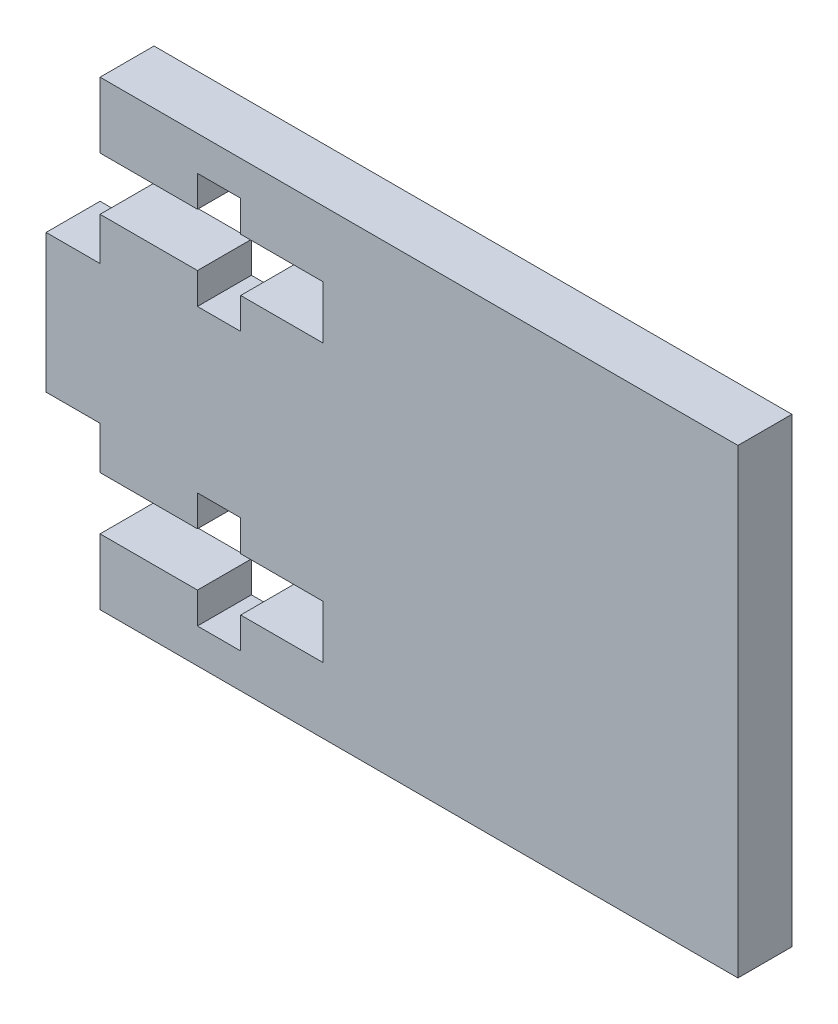
ISO-10303-21;
HEADER;
FILE_DESCRIPTION(('STEP AP214'),'2;1');
FILE_NAME('part.step','',(''),(''),'','','');
FILE_SCHEMA(('AUTOMOTIVE_DESIGN { 1 0 10303 214 1 1 1 1 }'));
ENDSEC;
DATA;
#1=APPLICATION_CONTEXT('core data for automotive mechanical design processes');
#2=APPLICATION_PROTOCOL_DEFINITION('international standard','automotive_design',2000,#1);
#3=PRODUCT_CONTEXT('',#1,'mechanical');
#4=PRODUCT('Part','Part','',(#3));
#5=PRODUCT_RELATED_PRODUCT_CATEGORY('part','',(#4));
#6=PRODUCT_DEFINITION_FORMATION('','',#4);
#7=PRODUCT_DEFINITION_CONTEXT('part definition',#1,'design');
#8=PRODUCT_DEFINITION('design','',#6,#7);
#9=PRODUCT_DEFINITION_SHAPE('','',#8);
#10=(LENGTH_UNIT() NAMED_UNIT(*) SI_UNIT(.MILLI.,.METRE.));
#11=(NAMED_UNIT(*) PLANE_ANGLE_UNIT() SI_UNIT($,.RADIAN.));
#12=(NAMED_UNIT(*) SI_UNIT($,.STERADIAN.) SOLID_ANGLE_UNIT());
#13=UNCERTAINTY_MEASURE_WITH_UNIT(LENGTH_MEASURE(1.E-05),#10,'distance_accuracy_value','');
#14=(GEOMETRIC_REPRESENTATION_CONTEXT(3) GLOBAL_UNCERTAINTY_ASSIGNED_CONTEXT((#13)) GLOBAL_UNIT_ASSIGNED_CONTEXT((#10,
#11,#12)) REPRESENTATION_CONTEXT('',''));
#15=CARTESIAN_POINT('',(0.,0.,0.));
#16=DIRECTION('',(0.,0.,1.));
#17=DIRECTION('',(1.,0.,0.));
#18=AXIS2_PLACEMENT_3D('',#15,#16,#17);
#19=CARTESIAN_POINT('',(-19.05,0.,2.9718));
#20=DIRECTION('',(-1.,0.,0.));
#21=DIRECTION('',(0.,-1.,0.));
#22=AXIS2_PLACEMENT_3D('',#19,#20,#21);
#23=PLANE('',#22);
#24=DIRECTION('',(0.,1.,0.));
#25=VECTOR('',#24,1.);
#26=CARTESIAN_POINT('',(-19.05,0.,2.9718));
#27=LINE('',#26,#25);
#28=CARTESIAN_POINT('',(-19.05,-3.81,2.9718));
#29=VERTEX_POINT('',#28);
#30=CARTESIAN_POINT('',(-19.05,3.81,2.9718));
#31=VERTEX_POINT('',#30);
#32=EDGE_CURVE('E314',#29,#31,#27,.T.);
#33=ORIENTED_EDGE('',*,*,#32,.T.);
#34=DIRECTION('',(0.,0.,-1.));
#35=VECTOR('',#34,1.);
#36=CARTESIAN_POINT('',(-19.05,3.81,2.9718));
#37=LINE('',#36,#35);
#38=CARTESIAN_POINT('',(-19.05,3.81,0.));
#39=VERTEX_POINT('',#38);
#40=EDGE_CURVE('E292',#31,#39,#37,.T.);
#41=ORIENTED_EDGE('',*,*,#40,.T.);
#42=DIRECTION('',(0.,1.,0.));
#43=VECTOR('',#42,1.);
#44=CARTESIAN_POINT('',(-19.05,0.,0.));
#45=LINE('',#44,#43);
#46=CARTESIAN_POINT('',(-19.05,-3.81,0.));
#47=VERTEX_POINT('',#46);
#48=EDGE_CURVE('E346',#47,#39,#45,.T.);
#49=ORIENTED_EDGE('',*,*,#48,.F.);
#50=DIRECTION('',(0.,0.,-1.));
#51=VECTOR('',#50,1.);
#52=CARTESIAN_POINT('',(-19.05,-3.81,2.9718));
#53=LINE('',#52,#51);
#54=EDGE_CURVE('E321',#29,#47,#53,.T.);
#55=ORIENTED_EDGE('',*,*,#54,.F.);
#56=EDGE_LOOP('',(#33,#41,#49,#55));
#57=FACE_BOUND('',#56,.T.);
#58=ADVANCED_FACE('F16',(#57),#23,.T.);
#59=CARTESIAN_POINT('',(0.,0.,0.));
#60=DIRECTION('',(0.,0.,1.));
#61=DIRECTION('',(1.,0.,0.));
#62=AXIS2_PLACEMENT_3D('',#59,#60,#61);
#63=PLANE('',#62);
#64=DIRECTION('',(0.,-1.,0.));
#65=VECTOR('',#64,1.);
#66=CARTESIAN_POINT('',(-16.0782,8.255,0.));
#67=LINE('',#66,#65);
#68=CARTESIAN_POINT('',(-16.0782,12.7,0.));
#69=VERTEX_POINT('',#68);
#70=CARTESIAN_POINT('',(-16.0782,9.0805,0.));
#71=VERTEX_POINT('',#70);
#72=EDGE_CURVE('E318',#69,#71,#67,.T.);
#73=ORIENTED_EDGE('',*,*,#72,.F.);
#74=DIRECTION('',(1.,0.,0.));
#75=VECTOR('',#74,1.);
#76=CARTESIAN_POINT('',(0.,12.7,0.));
#77=LINE('',#76,#75);
#78=CARTESIAN_POINT('',(19.05,12.7,0.));
#79=VERTEX_POINT('',#78);
#80=EDGE_CURVE('E324',#69,#79,#77,.T.);
#81=ORIENTED_EDGE('',*,*,#80,.T.);
#82=DIRECTION('',(0.,1.,0.));
#83=VECTOR('',#82,1.);
#84=CARTESIAN_POINT('',(19.05,0.,0.));
#85=LINE('',#84,#83);
#86=CARTESIAN_POINT('',(19.05,-12.7,0.));
#87=VERTEX_POINT('',#86);
#88=EDGE_CURVE('E333',#87,#79,#85,.T.);
#89=ORIENTED_EDGE('',*,*,#88,.F.);
#90=DIRECTION('',(1.,0.,0.));
#91=VECTOR('',#90,1.);
#92=CARTESIAN_POINT('',(0.,-12.7,0.));
#93=LINE('',#92,#91);
#94=CARTESIAN_POINT('',(-16.0782,-12.7,0.));
#95=VERTEX_POINT('',#94);
#96=EDGE_CURVE('E348',#95,#87,#93,.T.);
#97=ORIENTED_EDGE('',*,*,#96,.F.);
#98=DIRECTION('',(0.,-1.,0.));
#99=VECTOR('',#98,1.);
#100=CARTESIAN_POINT('',(-16.0782,-8.255,0.));
#101=LINE('',#100,#99);
#102=CARTESIAN_POINT('',(-16.0782,-9.0805,0.));
#103=VERTEX_POINT('',#102);
#104=EDGE_CURVE('E712',#103,#95,#101,.T.);
#105=ORIENTED_EDGE('',*,*,#104,.F.);
#106=DIRECTION('',(1.,0.,0.));
#107=VECTOR('',#106,1.);
#108=CARTESIAN_POINT('',(-11.43,-9.0805,0.));
#109=LINE('',#108,#107);
#110=CARTESIAN_POINT('',(-10.715625,-9.0805,0.));
#111=VERTEX_POINT('',#110);
#112=EDGE_CURVE('E439',#103,#111,#109,.T.);
#113=ORIENTED_EDGE('',*,*,#112,.T.);
#114=DIRECTION('',(0.,1.,0.));
#115=VECTOR('',#114,1.);
#116=CARTESIAN_POINT('',(-10.715625,-7.62,0.));
#117=LINE('',#116,#115);
#118=CARTESIAN_POINT('',(-10.715625,-10.795,0.));
#119=VERTEX_POINT('',#118);
#120=EDGE_CURVE('E522',#119,#111,#117,.T.);
#121=ORIENTED_EDGE('',*,*,#120,.F.);
#122=DIRECTION('',(-1.,0.,0.));
#123=VECTOR('',#122,1.);
#124=CARTESIAN_POINT('',(-9.525,-10.795,0.));
#125=LINE('',#124,#123);
#126=CARTESIAN_POINT('',(-8.334375,-10.795,0.));
#127=VERTEX_POINT('',#126);
#128=EDGE_CURVE('E535',#127,#119,#125,.T.);
#129=ORIENTED_EDGE('',*,*,#128,.F.);
#130=DIRECTION('',(0.,1.,0.));
#131=VECTOR('',#130,1.);
#132=CARTESIAN_POINT('',(-8.334375,-7.62,0.));
#133=LINE('',#132,#131);
#134=CARTESIAN_POINT('',(-8.334375,-9.0805,0.));
#135=VERTEX_POINT('',#134);
#136=EDGE_CURVE('E541',#127,#135,#133,.T.);
#137=ORIENTED_EDGE('',*,*,#136,.T.);
#138=CARTESIAN_POINT('',(-3.81,-9.0805,0.));
#139=VERTEX_POINT('',#138);
#140=EDGE_CURVE('E437',#135,#139,#109,.T.);
#141=ORIENTED_EDGE('',*,*,#140,.T.);
#142=DIRECTION('',(0.,-1.,0.));
#143=VECTOR('',#142,1.);
#144=CARTESIAN_POINT('',(-3.81,-7.62,0.));
#145=LINE('',#144,#143);
#146=CARTESIAN_POINT('',(-3.81,-6.1595,0.));
#147=VERTEX_POINT('',#146);
#148=EDGE_CURVE('E442',#147,#139,#145,.T.);
#149=ORIENTED_EDGE('',*,*,#148,.F.);
#150=DIRECTION('',(1.,0.,0.));
#151=VECTOR('',#150,1.);
#152=CARTESIAN_POINT('',(-11.43,-6.1595,0.));
#153=LINE('',#152,#151);
#154=CARTESIAN_POINT('',(-8.334375,-6.1595,0.));
#155=VERTEX_POINT('',#154);
#156=EDGE_CURVE('E438',#155,#147,#153,.T.);
#157=ORIENTED_EDGE('',*,*,#156,.F.);
#158=CARTESIAN_POINT('',(-8.334375,-4.445,0.));
#159=VERTEX_POINT('',#158);
#160=EDGE_CURVE('E539',#155,#159,#133,.T.);
#161=ORIENTED_EDGE('',*,*,#160,.T.);
#162=DIRECTION('',(-1.,0.,0.));
#163=VECTOR('',#162,1.);
#164=CARTESIAN_POINT('',(-9.525,-4.445,0.));
#165=LINE('',#164,#163);
#166=CARTESIAN_POINT('',(-10.715625,-4.445,0.));
#167=VERTEX_POINT('',#166);
#168=EDGE_CURVE('E545',#159,#167,#165,.T.);
#169=ORIENTED_EDGE('',*,*,#168,.T.);
#170=CARTESIAN_POINT('',(-10.715625,-6.1595,0.));
#171=VERTEX_POINT('',#170);
#172=EDGE_CURVE('E549',#171,#167,#117,.T.);
#173=ORIENTED_EDGE('',*,*,#172,.F.);
#174=CARTESIAN_POINT('',(-16.0782,-6.1595,0.));
#175=VERTEX_POINT('',#174);
#176=EDGE_CURVE('E434',#175,#171,#153,.T.);
#177=ORIENTED_EDGE('',*,*,#176,.F.);
#178=CARTESIAN_POINT('',(-16.0782,-3.81,0.));
#179=VERTEX_POINT('',#178);
#180=EDGE_CURVE('E36',#179,#175,#101,.T.);
#181=ORIENTED_EDGE('',*,*,#180,.F.);
#182=DIRECTION('',(1.,0.,0.));
#183=VECTOR('',#182,1.);
#184=CARTESIAN_POINT('',(-17.5641,-3.81,0.));
#185=LINE('',#184,#183);
#186=EDGE_CURVE('E708',#47,#179,#185,.T.);
#187=ORIENTED_EDGE('',*,*,#186,.F.);
#188=ORIENTED_EDGE('',*,*,#48,.T.);
#189=DIRECTION('',(1.,0.,0.));
#190=VECTOR('',#189,1.);
#191=CARTESIAN_POINT('',(-17.5641,3.81,0.));
#192=LINE('',#191,#190);
#193=CARTESIAN_POINT('',(-16.0782,3.81,0.));
#194=VERTEX_POINT('',#193);
#195=EDGE_CURVE('E299',#39,#194,#192,.T.);
#196=ORIENTED_EDGE('',*,*,#195,.T.);
#197=CARTESIAN_POINT('',(-16.0782,6.1595,0.));
#198=VERTEX_POINT('',#197);
#199=EDGE_CURVE('E384',#198,#194,#67,.T.);
#200=ORIENTED_EDGE('',*,*,#199,.F.);
#201=DIRECTION('',(1.,0.,0.));
#202=VECTOR('',#201,1.);
#203=CARTESIAN_POINT('',(-11.43,6.1595,0.));
#204=LINE('',#203,#202);
#205=CARTESIAN_POINT('',(-10.715625,6.1595,0.));
#206=VERTEX_POINT('',#205);
#207=EDGE_CURVE('E391',#198,#206,#204,.T.);
#208=ORIENTED_EDGE('',*,*,#207,.T.);
#209=DIRECTION('',(0.,1.,0.));
#210=VECTOR('',#209,1.);
#211=CARTESIAN_POINT('',(-10.715625,7.62,0.));
#212=LINE('',#211,#210);
#213=CARTESIAN_POINT('',(-10.715625,4.445,0.));
#214=VERTEX_POINT('',#213);
#215=EDGE_CURVE('E494',#214,#206,#212,.T.);
#216=ORIENTED_EDGE('',*,*,#215,.F.);
#217=DIRECTION('',(-1.,0.,0.));
#218=VECTOR('',#217,1.);
#219=CARTESIAN_POINT('',(-9.525,4.445,0.));
#220=LINE('',#219,#218);
#221=CARTESIAN_POINT('',(-8.334375,4.445,0.));
#222=VERTEX_POINT('',#221);
#223=EDGE_CURVE('E564',#222,#214,#220,.T.);
#224=ORIENTED_EDGE('',*,*,#223,.F.);
#225=DIRECTION('',(0.,1.,0.));
#226=VECTOR('',#225,1.);
#227=CARTESIAN_POINT('',(-8.334375,7.62,0.));
#228=LINE('',#227,#226);
#229=CARTESIAN_POINT('',(-8.334375,6.1595,0.));
#230=VERTEX_POINT('',#229);
#231=EDGE_CURVE('E501',#222,#230,#228,.T.);
#232=ORIENTED_EDGE('',*,*,#231,.T.);
#233=CARTESIAN_POINT('',(-3.81,6.1595,0.));
#234=VERTEX_POINT('',#233);
#235=EDGE_CURVE('E399',#230,#234,#204,.T.);
#236=ORIENTED_EDGE('',*,*,#235,.T.);
#237=DIRECTION('',(0.,-1.,0.));
#238=VECTOR('',#237,1.);
#239=CARTESIAN_POINT('',(-3.81,7.62,0.));
#240=LINE('',#239,#238);
#241=CARTESIAN_POINT('',(-3.81,9.0805,0.));
#242=VERTEX_POINT('',#241);
#243=EDGE_CURVE('E398',#242,#234,#240,.T.);
#244=ORIENTED_EDGE('',*,*,#243,.F.);
#245=DIRECTION('',(1.,0.,0.));
#246=VECTOR('',#245,1.);
#247=CARTESIAN_POINT('',(-11.43,9.0805,0.));
#248=LINE('',#247,#246);
#249=CARTESIAN_POINT('',(-8.334375,9.0805,0.));
#250=VERTEX_POINT('',#249);
#251=EDGE_CURVE('E454',#250,#242,#248,.T.);
#252=ORIENTED_EDGE('',*,*,#251,.F.);
#253=CARTESIAN_POINT('',(-8.334375,10.795,0.));
#254=VERTEX_POINT('',#253);
#255=EDGE_CURVE('E611',#250,#254,#228,.T.);
#256=ORIENTED_EDGE('',*,*,#255,.T.);
#257=DIRECTION('',(-1.,0.,0.));
#258=VECTOR('',#257,1.);
#259=CARTESIAN_POINT('',(-9.525,10.795,0.));
#260=LINE('',#259,#258);
#261=CARTESIAN_POINT('',(-10.715625,10.795,0.));
#262=VERTEX_POINT('',#261);
#263=EDGE_CURVE('E492',#254,#262,#260,.T.);
#264=ORIENTED_EDGE('',*,*,#263,.T.);
#265=CARTESIAN_POINT('',(-10.715625,9.0805,0.));
#266=VERTEX_POINT('',#265);
#267=EDGE_CURVE('E481',#266,#262,#212,.T.);
#268=ORIENTED_EDGE('',*,*,#267,.F.);
#269=EDGE_CURVE('E409',#71,#266,#248,.T.);
#270=ORIENTED_EDGE('',*,*,#269,.F.);
#271=EDGE_LOOP('',(#73,#81,#89,#97,#105,#113,#121,#129,#137,#141,#149,#157,#161,#169,#173,#177,
#181,#187,#188,#196,#200,#208,#216,#224,#232,#236,#244,#252,#256,#264,#268,#270));
#272=FACE_BOUND('',#271,.T.);
#273=ADVANCED_FACE('F389',(#272),#63,.F.);
#274=CARTESIAN_POINT('',(0.,0.,2.9718));
#275=DIRECTION('',(0.,0.,1.));
#276=DIRECTION('',(1.,0.,0.));
#277=AXIS2_PLACEMENT_3D('',#274,#275,#276);
#278=PLANE('',#277);
#279=DIRECTION('',(1.,0.,0.));
#280=VECTOR('',#279,1.);
#281=CARTESIAN_POINT('',(0.,12.7,2.9718));
#282=LINE('',#281,#280);
#283=CARTESIAN_POINT('',(-16.0782,12.7,2.9718));
#284=VERTEX_POINT('',#283);
#285=CARTESIAN_POINT('',(19.05,12.7,2.9718));
#286=VERTEX_POINT('',#285);
#287=EDGE_CURVE('E342',#284,#286,#282,.T.);
#288=ORIENTED_EDGE('',*,*,#287,.F.);
#289=DIRECTION('',(0.,-1.,0.));
#290=VECTOR('',#289,1.);
#291=CARTESIAN_POINT('',(-16.0782,8.255,2.9718));
#292=LINE('',#291,#290);
#293=CARTESIAN_POINT('',(-16.0782,9.0805,2.9718));
#294=VERTEX_POINT('',#293);
#295=EDGE_CURVE('E975',#284,#294,#292,.T.);
#296=ORIENTED_EDGE('',*,*,#295,.T.);
#297=DIRECTION('',(1.,0.,0.));
#298=VECTOR('',#297,1.);
#299=CARTESIAN_POINT('',(-11.43,9.0805,2.9718));
#300=LINE('',#299,#298);
#301=CARTESIAN_POINT('',(-10.715625,9.0805,2.9718));
#302=VERTEX_POINT('',#301);
#303=EDGE_CURVE('E575',#294,#302,#300,.T.);
#304=ORIENTED_EDGE('',*,*,#303,.T.);
#305=DIRECTION('',(0.,1.,0.));
#306=VECTOR('',#305,1.);
#307=CARTESIAN_POINT('',(-10.715625,7.62,2.9718));
#308=LINE('',#307,#306);
#309=CARTESIAN_POINT('',(-10.715625,10.795,2.9718));
#310=VERTEX_POINT('',#309);
#311=EDGE_CURVE('E484',#302,#310,#308,.T.);
#312=ORIENTED_EDGE('',*,*,#311,.T.);
#313=DIRECTION('',(-1.,0.,0.));
#314=VECTOR('',#313,1.);
#315=CARTESIAN_POINT('',(-9.525,10.795,2.9718));
#316=LINE('',#315,#314);
#317=CARTESIAN_POINT('',(-8.334375,10.795,2.9718));
#318=VERTEX_POINT('',#317);
#319=EDGE_CURVE('E617',#318,#310,#316,.T.);
#320=ORIENTED_EDGE('',*,*,#319,.F.);
#321=DIRECTION('',(0.,1.,0.));
#322=VECTOR('',#321,1.);
#323=CARTESIAN_POINT('',(-8.334375,7.62,2.9718));
#324=LINE('',#323,#322);
#325=CARTESIAN_POINT('',(-8.334375,9.0805,2.9718));
#326=VERTEX_POINT('',#325);
#327=EDGE_CURVE('E618',#326,#318,#324,.T.);
#328=ORIENTED_EDGE('',*,*,#327,.F.);
#329=CARTESIAN_POINT('',(-3.81,9.0805,2.9718));
#330=VERTEX_POINT('',#329);
#331=EDGE_CURVE('E406',#326,#330,#300,.T.);
#332=ORIENTED_EDGE('',*,*,#331,.T.);
#333=DIRECTION('',(0.,-1.,0.));
#334=VECTOR('',#333,1.);
#335=CARTESIAN_POINT('',(-3.81,7.62,2.9718));
#336=LINE('',#335,#334);
#337=CARTESIAN_POINT('',(-3.81,6.1595,2.9718));
#338=VERTEX_POINT('',#337);
#339=EDGE_CURVE('E417',#330,#338,#336,.T.);
#340=ORIENTED_EDGE('',*,*,#339,.T.);
#341=DIRECTION('',(1.,0.,0.));
#342=VECTOR('',#341,1.);
#343=CARTESIAN_POINT('',(-11.43,6.1595,2.9718));
#344=LINE('',#343,#342);
#345=CARTESIAN_POINT('',(-8.334375,6.1595,2.9718));
#346=VERTEX_POINT('',#345);
#347=EDGE_CURVE('E577',#346,#338,#344,.T.);
#348=ORIENTED_EDGE('',*,*,#347,.F.);
#349=CARTESIAN_POINT('',(-8.334375,4.445,2.9718));
#350=VERTEX_POINT('',#349);
#351=EDGE_CURVE('E614',#350,#346,#324,.T.);
#352=ORIENTED_EDGE('',*,*,#351,.F.);
#353=DIRECTION('',(-1.,0.,0.));
#354=VECTOR('',#353,1.);
#355=CARTESIAN_POINT('',(-9.525,4.445,2.9718));
#356=LINE('',#355,#354);
#357=CARTESIAN_POINT('',(-10.715625,4.445,2.9718));
#358=VERTEX_POINT('',#357);
#359=EDGE_CURVE('E499',#350,#358,#356,.T.);
#360=ORIENTED_EDGE('',*,*,#359,.T.);
#361=CARTESIAN_POINT('',(-10.715625,6.1595,2.9718));
#362=VERTEX_POINT('',#361);
#363=EDGE_CURVE('E509',#358,#362,#308,.T.);
#364=ORIENTED_EDGE('',*,*,#363,.T.);
#365=CARTESIAN_POINT('',(-16.0782,6.1595,2.9718));
#366=VERTEX_POINT('',#365);
#367=EDGE_CURVE('E578',#366,#362,#344,.T.);
#368=ORIENTED_EDGE('',*,*,#367,.F.);
#369=CARTESIAN_POINT('',(-16.0782,3.81,2.9718));
#370=VERTEX_POINT('',#369);
#371=EDGE_CURVE('E316',#366,#370,#292,.T.);
#372=ORIENTED_EDGE('',*,*,#371,.T.);
#373=DIRECTION('',(1.,0.,0.));
#374=VECTOR('',#373,1.);
#375=CARTESIAN_POINT('',(-17.5641,3.81,2.9718));
#376=LINE('',#375,#374);
#377=EDGE_CURVE('E296',#31,#370,#376,.T.);
#378=ORIENTED_EDGE('',*,*,#377,.F.);
#379=ORIENTED_EDGE('',*,*,#32,.F.);
#380=DIRECTION('',(1.,0.,0.));
#381=VECTOR('',#380,1.);
#382=CARTESIAN_POINT('',(-17.5641,-3.81,2.9718));
#383=LINE('',#382,#381);
#384=CARTESIAN_POINT('',(-16.0782,-3.81,2.9718));
#385=VERTEX_POINT('',#384);
#386=EDGE_CURVE('E698',#29,#385,#383,.T.);
#387=ORIENTED_EDGE('',*,*,#386,.T.);
#388=DIRECTION('',(0.,-1.,0.));
#389=VECTOR('',#388,1.);
#390=CARTESIAN_POINT('',(-16.0782,-8.255,2.9718));
#391=LINE('',#390,#389);
#392=CARTESIAN_POINT('',(-16.0782,-6.1595,2.9718));
#393=VERTEX_POINT('',#392);
#394=EDGE_CURVE('E697',#385,#393,#391,.T.);
#395=ORIENTED_EDGE('',*,*,#394,.T.);
#396=DIRECTION('',(1.,0.,0.));
#397=VECTOR('',#396,1.);
#398=CARTESIAN_POINT('',(-11.43,-6.1595,2.9718));
#399=LINE('',#398,#397);
#400=CARTESIAN_POINT('',(-10.715625,-6.1595,2.9718));
#401=VERTEX_POINT('',#400);
#402=EDGE_CURVE('E421',#393,#401,#399,.T.);
#403=ORIENTED_EDGE('',*,*,#402,.T.);
#404=DIRECTION('',(0.,1.,0.));
#405=VECTOR('',#404,1.);
#406=CARTESIAN_POINT('',(-10.715625,-7.62,2.9718));
#407=LINE('',#406,#405);
#408=CARTESIAN_POINT('',(-10.715625,-4.445,2.9718));
#409=VERTEX_POINT('',#408);
#410=EDGE_CURVE('E529',#401,#409,#407,.T.);
#411=ORIENTED_EDGE('',*,*,#410,.T.);
#412=DIRECTION('',(-1.,0.,0.));
#413=VECTOR('',#412,1.);
#414=CARTESIAN_POINT('',(-9.525,-4.445,2.9718));
#415=LINE('',#414,#413);
#416=CARTESIAN_POINT('',(-8.334375,-4.445,2.9718));
#417=VERTEX_POINT('',#416);
#418=EDGE_CURVE('E526',#417,#409,#415,.T.);
#419=ORIENTED_EDGE('',*,*,#418,.F.);
#420=DIRECTION('',(0.,1.,0.));
#421=VECTOR('',#420,1.);
#422=CARTESIAN_POINT('',(-8.334375,-7.62,2.9718));
#423=LINE('',#422,#421);
#424=CARTESIAN_POINT('',(-8.334375,-6.1595,2.9718));
#425=VERTEX_POINT('',#424);
#426=EDGE_CURVE('E521',#425,#417,#423,.T.);
#427=ORIENTED_EDGE('',*,*,#426,.F.);
#428=CARTESIAN_POINT('',(-3.81,-6.1595,2.9718));
#429=VERTEX_POINT('',#428);
#430=EDGE_CURVE('E425',#425,#429,#399,.T.);
#431=ORIENTED_EDGE('',*,*,#430,.T.);
#432=DIRECTION('',(0.,-1.,0.));
#433=VECTOR('',#432,1.);
#434=CARTESIAN_POINT('',(-3.81,-7.62,2.9718));
#435=LINE('',#434,#433);
#436=CARTESIAN_POINT('',(-3.81,-9.0805,2.9718));
#437=VERTEX_POINT('',#436);
#438=EDGE_CURVE('E429',#429,#437,#435,.T.);
#439=ORIENTED_EDGE('',*,*,#438,.T.);
#440=DIRECTION('',(1.,0.,0.));
#441=VECTOR('',#440,1.);
#442=CARTESIAN_POINT('',(-11.43,-9.0805,2.9718));
#443=LINE('',#442,#441);
#444=CARTESIAN_POINT('',(-8.334375,-9.0805,2.9718));
#445=VERTEX_POINT('',#444);
#446=EDGE_CURVE('E424',#445,#437,#443,.T.);
#447=ORIENTED_EDGE('',*,*,#446,.F.);
#448=CARTESIAN_POINT('',(-8.334375,-10.795,2.9718));
#449=VERTEX_POINT('',#448);
#450=EDGE_CURVE('E523',#449,#445,#423,.T.);
#451=ORIENTED_EDGE('',*,*,#450,.F.);
#452=DIRECTION('',(-1.,0.,0.));
#453=VECTOR('',#452,1.);
#454=CARTESIAN_POINT('',(-9.525,-10.795,2.9718));
#455=LINE('',#454,#453);
#456=CARTESIAN_POINT('',(-10.715625,-10.795,2.9718));
#457=VERTEX_POINT('',#456);
#458=EDGE_CURVE('E517',#449,#457,#455,.T.);
#459=ORIENTED_EDGE('',*,*,#458,.T.);
#460=CARTESIAN_POINT('',(-10.715625,-9.0805,2.9718));
#461=VERTEX_POINT('',#460);
#462=EDGE_CURVE('E530',#457,#461,#407,.T.);
#463=ORIENTED_EDGE('',*,*,#462,.T.);
#464=CARTESIAN_POINT('',(-16.0782,-9.0805,2.9718));
#465=VERTEX_POINT('',#464);
#466=EDGE_CURVE('E426',#465,#461,#443,.T.);
#467=ORIENTED_EDGE('',*,*,#466,.F.);
#468=CARTESIAN_POINT('',(-16.0782,-12.7,2.9718));
#469=VERTEX_POINT('',#468);
#470=EDGE_CURVE('E47',#465,#469,#391,.T.);
#471=ORIENTED_EDGE('',*,*,#470,.T.);
#472=DIRECTION('',(1.,0.,0.));
#473=VECTOR('',#472,1.);
#474=CARTESIAN_POINT('',(0.,-12.7,2.9718));
#475=LINE('',#474,#473);
#476=CARTESIAN_POINT('',(19.05,-12.7,2.9718));
#477=VERTEX_POINT('',#476);
#478=EDGE_CURVE('E323',#469,#477,#475,.T.);
#479=ORIENTED_EDGE('',*,*,#478,.T.);
#480=DIRECTION('',(0.,1.,0.));
#481=VECTOR('',#480,1.);
#482=CARTESIAN_POINT('',(19.05,0.,2.9718));
#483=LINE('',#482,#481);
#484=EDGE_CURVE('E330',#477,#286,#483,.T.);
#485=ORIENTED_EDGE('',*,*,#484,.T.);
#486=EDGE_LOOP('',(#288,#296,#304,#312,#320,#328,#332,#340,#348,#352,#360,#364,#368,#372,#378,
#379,#387,#395,#403,#411,#419,#427,#431,#439,#447,#451,#459,#463,#467,#471,#479,#485));
#487=FACE_BOUND('',#486,.T.);
#488=ADVANCED_FACE('F312',(#487),#278,.T.);
#489=CARTESIAN_POINT('',(-11.43,-6.1595,2.9718));
#490=DIRECTION('',(0.,1.,0.));
#491=DIRECTION('',(0.,0.,1.));
#492=AXIS2_PLACEMENT_3D('',#489,#490,#491);
#493=PLANE('',#492);
#494=DIRECTION('',(0.,0.,1.));
#495=VECTOR('',#494,1.);
#496=CARTESIAN_POINT('',(-8.334375,-6.1595,2.9718));
#497=LINE('',#496,#495);
#498=EDGE_CURVE('E572',#155,#425,#497,.T.);
#499=ORIENTED_EDGE('',*,*,#498,.F.);
#500=ORIENTED_EDGE('',*,*,#156,.T.);
#501=DIRECTION('',(0.,0.,-1.));
#502=VECTOR('',#501,1.);
#503=CARTESIAN_POINT('',(-3.81,-6.1595,2.9718));
#504=LINE('',#503,#502);
#505=EDGE_CURVE('E433',#429,#147,#504,.T.);
#506=ORIENTED_EDGE('',*,*,#505,.F.);
#507=ORIENTED_EDGE('',*,*,#430,.F.);
#508=EDGE_LOOP('',(#499,#500,#506,#507));
#509=FACE_BOUND('',#508,.T.);
#510=ADVANCED_FACE('F659',(#509),#493,.F.);
#511=CARTESIAN_POINT('',(-11.43,-9.0805,2.9718));
#512=DIRECTION('',(0.,1.,0.));
#513=DIRECTION('',(0.,0.,1.));
#514=AXIS2_PLACEMENT_3D('',#511,#512,#513);
#515=PLANE('',#514);
#516=ORIENTED_EDGE('',*,*,#140,.F.);
#517=DIRECTION('',(0.,0.,1.));
#518=VECTOR('',#517,1.);
#519=CARTESIAN_POINT('',(-8.334375,-9.0805,2.9718));
#520=LINE('',#519,#518);
#521=EDGE_CURVE('E374',#135,#445,#520,.T.);
#522=ORIENTED_EDGE('',*,*,#521,.T.);
#523=ORIENTED_EDGE('',*,*,#446,.T.);
#524=DIRECTION('',(0.,0.,-1.));
#525=VECTOR('',#524,1.);
#526=CARTESIAN_POINT('',(-3.81,-9.0805,2.9718));
#527=LINE('',#526,#525);
#528=EDGE_CURVE('E336',#437,#139,#527,.T.);
#529=ORIENTED_EDGE('',*,*,#528,.T.);
#530=EDGE_LOOP('',(#516,#522,#523,#529));
#531=FACE_BOUND('',#530,.T.);
#532=ADVANCED_FACE('F650',(#531),#515,.T.);
#533=CARTESIAN_POINT('',(-11.43,9.0805,2.9718));
#534=DIRECTION('',(0.,1.,0.));
#535=DIRECTION('',(0.,0.,1.));
#536=AXIS2_PLACEMENT_3D('',#533,#534,#535);
#537=PLANE('',#536);
#538=DIRECTION('',(0.,0.,1.));
#539=VECTOR('',#538,1.);
#540=CARTESIAN_POINT('',(-8.334375,9.0805,2.9718));
#541=LINE('',#540,#539);
#542=EDGE_CURVE('E486',#250,#326,#541,.T.);
#543=ORIENTED_EDGE('',*,*,#542,.F.);
#544=ORIENTED_EDGE('',*,*,#251,.T.);
#545=DIRECTION('',(0.,0.,-1.));
#546=VECTOR('',#545,1.);
#547=CARTESIAN_POINT('',(-3.81,9.0805,2.9718));
#548=LINE('',#547,#546);
#549=EDGE_CURVE('E413',#330,#242,#548,.T.);
#550=ORIENTED_EDGE('',*,*,#549,.F.);
#551=ORIENTED_EDGE('',*,*,#331,.F.);
#552=EDGE_LOOP('',(#543,#544,#550,#551));
#553=FACE_BOUND('',#552,.T.);
#554=ADVANCED_FACE('F647',(#553),#537,.F.);
#555=CARTESIAN_POINT('',(-11.43,6.1595,2.9718));
#556=DIRECTION('',(0.,1.,0.));
#557=DIRECTION('',(0.,0.,1.));
#558=AXIS2_PLACEMENT_3D('',#555,#556,#557);
#559=PLANE('',#558);
#560=ORIENTED_EDGE('',*,*,#235,.F.);
#561=DIRECTION('',(0.,0.,1.));
#562=VECTOR('',#561,1.);
#563=CARTESIAN_POINT('',(-8.334375,6.1595,2.9718));
#564=LINE('',#563,#562);
#565=EDGE_CURVE('E366',#230,#346,#564,.T.);
#566=ORIENTED_EDGE('',*,*,#565,.T.);
#567=ORIENTED_EDGE('',*,*,#347,.T.);
#568=DIRECTION('',(0.,0.,-1.));
#569=VECTOR('',#568,1.);
#570=CARTESIAN_POINT('',(-3.81,6.1595,2.9718));
#571=LINE('',#570,#569);
#572=EDGE_CURVE('E349',#338,#234,#571,.T.);
#573=ORIENTED_EDGE('',*,*,#572,.T.);
#574=EDGE_LOOP('',(#560,#566,#567,#573));
#575=FACE_BOUND('',#574,.T.);
#576=ADVANCED_FACE('F593',(#575),#559,.T.);
#577=CARTESIAN_POINT('',(0.,-12.7,2.9718));
#578=DIRECTION('',(0.,1.,0.));
#579=DIRECTION('',(0.,0.,1.));
#580=AXIS2_PLACEMENT_3D('',#577,#578,#579);
#581=PLANE('',#580);
#582=ORIENTED_EDGE('',*,*,#478,.F.);
#583=DIRECTION('',(0.,0.,-1.));
#584=VECTOR('',#583,1.);
#585=CARTESIAN_POINT('',(-16.0782,-12.7,2.9718));
#586=LINE('',#585,#584);
#587=EDGE_CURVE('E691',#469,#95,#586,.T.);
#588=ORIENTED_EDGE('',*,*,#587,.T.);
#589=ORIENTED_EDGE('',*,*,#96,.T.);
#590=DIRECTION('',(0.,0.,-1.));
#591=VECTOR('',#590,1.);
#592=CARTESIAN_POINT('',(19.05,-12.7,2.9718));
#593=LINE('',#592,#591);
#594=EDGE_CURVE('E358',#477,#87,#593,.T.);
#595=ORIENTED_EDGE('',*,*,#594,.F.);
#596=EDGE_LOOP('',(#582,#588,#589,#595));
#597=FACE_BOUND('',#596,.T.);
#598=ADVANCED_FACE('F657',(#597),#581,.F.);
#599=CARTESIAN_POINT('',(19.05,0.,2.9718));
#600=DIRECTION('',(-1.,0.,0.));
#601=DIRECTION('',(0.,-1.,0.));
#602=AXIS2_PLACEMENT_3D('',#599,#600,#601);
#603=PLANE('',#602);
#604=ORIENTED_EDGE('',*,*,#88,.T.);
#605=DIRECTION('',(0.,0.,-1.));
#606=VECTOR('',#605,1.);
#607=CARTESIAN_POINT('',(19.05,12.7,2.9718));
#608=LINE('',#607,#606);
#609=EDGE_CURVE('E345',#286,#79,#608,.T.);
#610=ORIENTED_EDGE('',*,*,#609,.F.);
#611=ORIENTED_EDGE('',*,*,#484,.F.);
#612=ORIENTED_EDGE('',*,*,#594,.T.);
#613=EDGE_LOOP('',(#604,#610,#611,#612));
#614=FACE_BOUND('',#613,.T.);
#615=ADVANCED_FACE('F680',(#614),#603,.F.);
#616=CARTESIAN_POINT('',(0.,12.7,2.9718));
#617=DIRECTION('',(0.,1.,0.));
#618=DIRECTION('',(0.,0.,1.));
#619=AXIS2_PLACEMENT_3D('',#616,#617,#618);
#620=PLANE('',#619);
#621=DIRECTION('',(0.,0.,-1.));
#622=VECTOR('',#621,1.);
#623=CARTESIAN_POINT('',(-16.0782,12.7,2.9718));
#624=LINE('',#623,#622);
#625=EDGE_CURVE('E978',#284,#69,#624,.T.);
#626=ORIENTED_EDGE('',*,*,#625,.F.);
#627=ORIENTED_EDGE('',*,*,#287,.T.);
#628=ORIENTED_EDGE('',*,*,#609,.T.);
#629=ORIENTED_EDGE('',*,*,#80,.F.);
#630=EDGE_LOOP('',(#626,#627,#628,#629));
#631=FACE_BOUND('',#630,.T.);
#632=ADVANCED_FACE('F676',(#631),#620,.T.);
#633=ORIENTED_EDGE('',*,*,#402,.F.);
#634=DIRECTION('',(0.,0.,-1.));
#635=VECTOR('',#634,1.);
#636=CARTESIAN_POINT('',(-16.0782,-6.1595,2.9718));
#637=LINE('',#636,#635);
#638=EDGE_CURVE('E540',#393,#175,#637,.T.);
#639=ORIENTED_EDGE('',*,*,#638,.T.);
#640=ORIENTED_EDGE('',*,*,#176,.T.);
#641=DIRECTION('',(0.,0.,1.));
#642=VECTOR('',#641,1.);
#643=CARTESIAN_POINT('',(-10.715625,-6.1595,2.9718));
#644=LINE('',#643,#642);
#645=EDGE_CURVE('E568',#171,#401,#644,.T.);
#646=ORIENTED_EDGE('',*,*,#645,.T.);
#647=EDGE_LOOP('',(#633,#639,#640,#646));
#648=FACE_BOUND('',#647,.T.);
#649=ADVANCED_FACE('F679',(#648),#493,.F.);
#650=DIRECTION('',(0.,0.,-1.));
#651=VECTOR('',#650,1.);
#652=CARTESIAN_POINT('',(-16.0782,-9.0805,2.9718));
#653=LINE('',#652,#651);
#654=EDGE_CURVE('E10',#465,#103,#653,.T.);
#655=ORIENTED_EDGE('',*,*,#654,.F.);
#656=ORIENTED_EDGE('',*,*,#466,.T.);
#657=DIRECTION('',(0.,0.,1.));
#658=VECTOR('',#657,1.);
#659=CARTESIAN_POINT('',(-10.715625,-9.0805,2.9718));
#660=LINE('',#659,#658);
#661=EDGE_CURVE('E370',#111,#461,#660,.T.);
#662=ORIENTED_EDGE('',*,*,#661,.F.);
#663=ORIENTED_EDGE('',*,*,#112,.F.);
#664=EDGE_LOOP('',(#655,#656,#662,#663));
#665=FACE_BOUND('',#664,.T.);
#666=ADVANCED_FACE('F661',(#665),#515,.T.);
#667=CARTESIAN_POINT('',(-3.81,-7.62,2.9718));
#668=DIRECTION('',(1.,0.,0.));
#669=DIRECTION('',(0.,1.,0.));
#670=AXIS2_PLACEMENT_3D('',#667,#668,#669);
#671=PLANE('',#670);
#672=ORIENTED_EDGE('',*,*,#148,.T.);
#673=ORIENTED_EDGE('',*,*,#528,.F.);
#674=ORIENTED_EDGE('',*,*,#438,.F.);
#675=ORIENTED_EDGE('',*,*,#505,.T.);
#676=EDGE_LOOP('',(#672,#673,#674,#675));
#677=FACE_BOUND('',#676,.T.);
#678=ADVANCED_FACE('F664',(#677),#671,.F.);
#679=ORIENTED_EDGE('',*,*,#303,.F.);
#680=DIRECTION('',(0.,0.,-1.));
#681=VECTOR('',#680,1.);
#682=CARTESIAN_POINT('',(-16.0782,9.0805,2.9718));
#683=LINE('',#682,#681);
#684=EDGE_CURVE('E305',#294,#71,#683,.T.);
#685=ORIENTED_EDGE('',*,*,#684,.T.);
#686=ORIENTED_EDGE('',*,*,#269,.T.);
#687=DIRECTION('',(0.,0.,1.));
#688=VECTOR('',#687,1.);
#689=CARTESIAN_POINT('',(-10.715625,9.0805,2.9718));
#690=LINE('',#689,#688);
#691=EDGE_CURVE('E475',#266,#302,#690,.T.);
#692=ORIENTED_EDGE('',*,*,#691,.T.);
#693=EDGE_LOOP('',(#679,#685,#686,#692));
#694=FACE_BOUND('',#693,.T.);
#695=ADVANCED_FACE('F474',(#694),#537,.F.);
#696=DIRECTION('',(0.,0.,-1.));
#697=VECTOR('',#696,1.);
#698=CARTESIAN_POINT('',(-16.0782,6.1595,2.9718));
#699=LINE('',#698,#697);
#700=EDGE_CURVE('E24',#366,#198,#699,.T.);
#701=ORIENTED_EDGE('',*,*,#700,.F.);
#702=ORIENTED_EDGE('',*,*,#367,.T.);
#703=DIRECTION('',(0.,0.,1.));
#704=VECTOR('',#703,1.);
#705=CARTESIAN_POINT('',(-10.715625,6.1595,2.9718));
#706=LINE('',#705,#704);
#707=EDGE_CURVE('E362',#206,#362,#706,.T.);
#708=ORIENTED_EDGE('',*,*,#707,.F.);
#709=ORIENTED_EDGE('',*,*,#207,.F.);
#710=EDGE_LOOP('',(#701,#702,#708,#709));
#711=FACE_BOUND('',#710,.T.);
#712=ADVANCED_FACE('F396',(#711),#559,.T.);
#713=CARTESIAN_POINT('',(-3.81,7.62,2.9718));
#714=DIRECTION('',(1.,0.,0.));
#715=DIRECTION('',(0.,0.,-1.));
#716=AXIS2_PLACEMENT_3D('',#713,#714,#715);
#717=PLANE('',#716);
#718=ORIENTED_EDGE('',*,*,#243,.T.);
#719=ORIENTED_EDGE('',*,*,#572,.F.);
#720=ORIENTED_EDGE('',*,*,#339,.F.);
#721=ORIENTED_EDGE('',*,*,#549,.T.);
#722=EDGE_LOOP('',(#718,#719,#720,#721));
#723=FACE_BOUND('',#722,.T.);
#724=ADVANCED_FACE('F589',(#723),#717,.F.);
#725=CARTESIAN_POINT('',(-10.715625,7.62,2.9718));
#726=DIRECTION('',(-1.,0.,0.));
#727=DIRECTION('',(0.,0.,1.));
#728=AXIS2_PLACEMENT_3D('',#725,#726,#727);
#729=PLANE('',#728);
#730=ORIENTED_EDGE('',*,*,#707,.T.);
#731=ORIENTED_EDGE('',*,*,#363,.F.);
#732=DIRECTION('',(0.,0.,-1.));
#733=VECTOR('',#732,1.);
#734=CARTESIAN_POINT('',(-10.715625,4.445,2.9718));
#735=LINE('',#734,#733);
#736=EDGE_CURVE('E505',#358,#214,#735,.T.);
#737=ORIENTED_EDGE('',*,*,#736,.T.);
#738=ORIENTED_EDGE('',*,*,#215,.T.);
#739=EDGE_LOOP('',(#730,#731,#737,#738));
#740=FACE_BOUND('',#739,.T.);
#741=ADVANCED_FACE('F643',(#740),#729,.F.);
#742=CARTESIAN_POINT('',(-8.334375,7.62,2.9718));
#743=DIRECTION('',(-1.,0.,0.));
#744=DIRECTION('',(0.,0.,1.));
#745=AXIS2_PLACEMENT_3D('',#742,#743,#744);
#746=PLANE('',#745);
#747=ORIENTED_EDGE('',*,*,#231,.F.);
#748=DIRECTION('',(0.,0.,-1.));
#749=VECTOR('',#748,1.);
#750=CARTESIAN_POINT('',(-8.334375,4.445,2.9718));
#751=LINE('',#750,#749);
#752=EDGE_CURVE('E487',#350,#222,#751,.T.);
#753=ORIENTED_EDGE('',*,*,#752,.F.);
#754=ORIENTED_EDGE('',*,*,#351,.T.);
#755=ORIENTED_EDGE('',*,*,#565,.F.);
#756=EDGE_LOOP('',(#747,#753,#754,#755));
#757=FACE_BOUND('',#756,.T.);
#758=ADVANCED_FACE('F645',(#757),#746,.T.);
#759=CARTESIAN_POINT('',(-9.525,4.445,2.9718));
#760=DIRECTION('',(0.,-1.,0.));
#761=DIRECTION('',(0.,0.,-1.));
#762=AXIS2_PLACEMENT_3D('',#759,#760,#761);
#763=PLANE('',#762);
#764=ORIENTED_EDGE('',*,*,#223,.T.);
#765=ORIENTED_EDGE('',*,*,#736,.F.);
#766=ORIENTED_EDGE('',*,*,#359,.F.);
#767=ORIENTED_EDGE('',*,*,#752,.T.);
#768=EDGE_LOOP('',(#764,#765,#766,#767));
#769=FACE_BOUND('',#768,.T.);
#770=ADVANCED_FACE('F638',(#769),#763,.F.);
#771=ORIENTED_EDGE('',*,*,#542,.T.);
#772=ORIENTED_EDGE('',*,*,#327,.T.);
#773=DIRECTION('',(0.,0.,-1.));
#774=VECTOR('',#773,1.);
#775=CARTESIAN_POINT('',(-8.334375,10.795,2.9718));
#776=LINE('',#775,#774);
#777=EDGE_CURVE('E512',#318,#254,#776,.T.);
#778=ORIENTED_EDGE('',*,*,#777,.T.);
#779=ORIENTED_EDGE('',*,*,#255,.F.);
#780=EDGE_LOOP('',(#771,#772,#778,#779));
#781=FACE_BOUND('',#780,.T.);
#782=ADVANCED_FACE('F646',(#781),#746,.T.);
#783=ORIENTED_EDGE('',*,*,#267,.T.);
#784=DIRECTION('',(0.,0.,-1.));
#785=VECTOR('',#784,1.);
#786=CARTESIAN_POINT('',(-10.715625,10.795,2.9718));
#787=LINE('',#786,#785);
#788=EDGE_CURVE('E508',#310,#262,#787,.T.);
#789=ORIENTED_EDGE('',*,*,#788,.F.);
#790=ORIENTED_EDGE('',*,*,#311,.F.);
#791=ORIENTED_EDGE('',*,*,#691,.F.);
#792=EDGE_LOOP('',(#783,#789,#790,#791));
#793=FACE_BOUND('',#792,.T.);
#794=ADVANCED_FACE('F479',(#793),#729,.F.);
#795=CARTESIAN_POINT('',(-9.525,10.795,2.9718));
#796=DIRECTION('',(0.,-1.,0.));
#797=DIRECTION('',(0.,0.,-1.));
#798=AXIS2_PLACEMENT_3D('',#795,#796,#797);
#799=PLANE('',#798);
#800=ORIENTED_EDGE('',*,*,#263,.F.);
#801=ORIENTED_EDGE('',*,*,#777,.F.);
#802=ORIENTED_EDGE('',*,*,#319,.T.);
#803=ORIENTED_EDGE('',*,*,#788,.T.);
#804=EDGE_LOOP('',(#800,#801,#802,#803));
#805=FACE_BOUND('',#804,.T.);
#806=ADVANCED_FACE('F773',(#805),#799,.T.);
#807=CARTESIAN_POINT('',(-10.715625,-7.62,2.9718));
#808=DIRECTION('',(-1.,0.,0.));
#809=DIRECTION('',(0.,-1.,0.));
#810=AXIS2_PLACEMENT_3D('',#807,#808,#809);
#811=PLANE('',#810);
#812=ORIENTED_EDGE('',*,*,#661,.T.);
#813=ORIENTED_EDGE('',*,*,#462,.F.);
#814=DIRECTION('',(0.,0.,-1.));
#815=VECTOR('',#814,1.);
#816=CARTESIAN_POINT('',(-10.715625,-10.795,2.9718));
#817=LINE('',#816,#815);
#818=EDGE_CURVE('E534',#457,#119,#817,.T.);
#819=ORIENTED_EDGE('',*,*,#818,.T.);
#820=ORIENTED_EDGE('',*,*,#120,.T.);
#821=EDGE_LOOP('',(#812,#813,#819,#820));
#822=FACE_BOUND('',#821,.T.);
#823=ADVANCED_FACE('F781',(#822),#811,.F.);
#824=CARTESIAN_POINT('',(-8.334375,-7.62,2.9718));
#825=DIRECTION('',(-1.,0.,0.));
#826=DIRECTION('',(0.,-1.,0.));
#827=AXIS2_PLACEMENT_3D('',#824,#825,#826);
#828=PLANE('',#827);
#829=ORIENTED_EDGE('',*,*,#136,.F.);
#830=DIRECTION('',(0.,0.,-1.));
#831=VECTOR('',#830,1.);
#832=CARTESIAN_POINT('',(-8.334375,-10.795,2.9718));
#833=LINE('',#832,#831);
#834=EDGE_CURVE('E562',#449,#127,#833,.T.);
#835=ORIENTED_EDGE('',*,*,#834,.F.);
#836=ORIENTED_EDGE('',*,*,#450,.T.);
#837=ORIENTED_EDGE('',*,*,#521,.F.);
#838=EDGE_LOOP('',(#829,#835,#836,#837));
#839=FACE_BOUND('',#838,.T.);
#840=ADVANCED_FACE('F776',(#839),#828,.T.);
#841=CARTESIAN_POINT('',(-9.525,-10.795,2.9718));
#842=DIRECTION('',(0.,-1.,0.));
#843=DIRECTION('',(0.,0.,-1.));
#844=AXIS2_PLACEMENT_3D('',#841,#842,#843);
#845=PLANE('',#844);
#846=ORIENTED_EDGE('',*,*,#128,.T.);
#847=ORIENTED_EDGE('',*,*,#818,.F.);
#848=ORIENTED_EDGE('',*,*,#458,.F.);
#849=ORIENTED_EDGE('',*,*,#834,.T.);
#850=EDGE_LOOP('',(#846,#847,#848,#849));
#851=FACE_BOUND('',#850,.T.);
#852=ADVANCED_FACE('F780',(#851),#845,.F.);
#853=ORIENTED_EDGE('',*,*,#498,.T.);
#854=ORIENTED_EDGE('',*,*,#426,.T.);
#855=DIRECTION('',(0.,0.,-1.));
#856=VECTOR('',#855,1.);
#857=CARTESIAN_POINT('',(-8.334375,-4.445,2.9718));
#858=LINE('',#857,#856);
#859=EDGE_CURVE('E559',#417,#159,#858,.T.);
#860=ORIENTED_EDGE('',*,*,#859,.T.);
#861=ORIENTED_EDGE('',*,*,#160,.F.);
#862=EDGE_LOOP('',(#853,#854,#860,#861));
#863=FACE_BOUND('',#862,.T.);
#864=ADVANCED_FACE('F784',(#863),#828,.T.);
#865=ORIENTED_EDGE('',*,*,#172,.T.);
#866=DIRECTION('',(0.,0.,-1.));
#867=VECTOR('',#866,1.);
#868=CARTESIAN_POINT('',(-10.715625,-4.445,2.9718));
#869=LINE('',#868,#867);
#870=EDGE_CURVE('E555',#409,#167,#869,.T.);
#871=ORIENTED_EDGE('',*,*,#870,.F.);
#872=ORIENTED_EDGE('',*,*,#410,.F.);
#873=ORIENTED_EDGE('',*,*,#645,.F.);
#874=EDGE_LOOP('',(#865,#871,#872,#873));
#875=FACE_BOUND('',#874,.T.);
#876=ADVANCED_FACE('F791',(#875),#811,.F.);
#877=CARTESIAN_POINT('',(-9.525,-4.445,2.9718));
#878=DIRECTION('',(0.,-1.,0.));
#879=DIRECTION('',(0.,0.,-1.));
#880=AXIS2_PLACEMENT_3D('',#877,#878,#879);
#881=PLANE('',#880);
#882=ORIENTED_EDGE('',*,*,#168,.F.);
#883=ORIENTED_EDGE('',*,*,#859,.F.);
#884=ORIENTED_EDGE('',*,*,#418,.T.);
#885=ORIENTED_EDGE('',*,*,#870,.T.);
#886=EDGE_LOOP('',(#882,#883,#884,#885));
#887=FACE_BOUND('',#886,.T.);
#888=ADVANCED_FACE('F801',(#887),#881,.T.);
#889=CARTESIAN_POINT('',(-16.0782,8.255,2.9718));
#890=DIRECTION('',(1.,0.,0.));
#891=DIRECTION('',(0.,0.,-1.));
#892=AXIS2_PLACEMENT_3D('',#889,#890,#891);
#893=PLANE('',#892);
#894=ORIENTED_EDGE('',*,*,#700,.T.);
#895=ORIENTED_EDGE('',*,*,#199,.T.);
#896=DIRECTION('',(0.,0.,-1.));
#897=VECTOR('',#896,1.);
#898=CARTESIAN_POINT('',(-16.0782,3.81,2.9718));
#899=LINE('',#898,#897);
#900=EDGE_CURVE('E306',#370,#194,#899,.T.);
#901=ORIENTED_EDGE('',*,*,#900,.F.);
#902=ORIENTED_EDGE('',*,*,#371,.F.);
#903=EDGE_LOOP('',(#894,#895,#901,#902));
#904=FACE_BOUND('',#903,.T.);
#905=ADVANCED_FACE('F383',(#904),#893,.F.);
#906=CARTESIAN_POINT('',(-17.5641,3.81,2.9718));
#907=DIRECTION('',(0.,1.,0.));
#908=DIRECTION('',(0.,0.,1.));
#909=AXIS2_PLACEMENT_3D('',#906,#907,#908);
#910=PLANE('',#909);
#911=ORIENTED_EDGE('',*,*,#195,.F.);
#912=ORIENTED_EDGE('',*,*,#40,.F.);
#913=ORIENTED_EDGE('',*,*,#377,.T.);
#914=ORIENTED_EDGE('',*,*,#900,.T.);
#915=EDGE_LOOP('',(#911,#912,#913,#914));
#916=FACE_BOUND('',#915,.T.);
#917=ADVANCED_FACE('F294',(#916),#910,.T.);
#918=ORIENTED_EDGE('',*,*,#295,.F.);
#919=ORIENTED_EDGE('',*,*,#625,.T.);
#920=ORIENTED_EDGE('',*,*,#72,.T.);
#921=ORIENTED_EDGE('',*,*,#684,.F.);
#922=EDGE_LOOP('',(#918,#919,#920,#921));
#923=FACE_BOUND('',#922,.T.);
#924=ADVANCED_FACE('F842',(#923),#893,.F.);
#925=CARTESIAN_POINT('',(-16.0782,-8.255,2.9718));
#926=DIRECTION('',(1.,0.,0.));
#927=DIRECTION('',(0.,0.,-1.));
#928=AXIS2_PLACEMENT_3D('',#925,#926,#927);
#929=PLANE('',#928);
#930=ORIENTED_EDGE('',*,*,#654,.T.);
#931=ORIENTED_EDGE('',*,*,#104,.T.);
#932=ORIENTED_EDGE('',*,*,#587,.F.);
#933=ORIENTED_EDGE('',*,*,#470,.F.);
#934=EDGE_LOOP('',(#930,#931,#932,#933));
#935=FACE_BOUND('',#934,.T.);
#936=ADVANCED_FACE('F853',(#935),#929,.F.);
#937=ORIENTED_EDGE('',*,*,#394,.F.);
#938=DIRECTION('',(0.,0.,-1.));
#939=VECTOR('',#938,1.);
#940=CARTESIAN_POINT('',(-16.0782,-3.81,2.9718));
#941=LINE('',#940,#939);
#942=EDGE_CURVE('E704',#385,#179,#941,.T.);
#943=ORIENTED_EDGE('',*,*,#942,.T.);
#944=ORIENTED_EDGE('',*,*,#180,.T.);
#945=ORIENTED_EDGE('',*,*,#638,.F.);
#946=EDGE_LOOP('',(#937,#943,#944,#945));
#947=FACE_BOUND('',#946,.T.);
#948=ADVANCED_FACE('F859',(#947),#929,.F.);
#949=CARTESIAN_POINT('',(-17.5641,-3.81,2.9718));
#950=DIRECTION('',(0.,1.,0.));
#951=DIRECTION('',(0.,0.,1.));
#952=AXIS2_PLACEMENT_3D('',#949,#950,#951);
#953=PLANE('',#952);
#954=ORIENTED_EDGE('',*,*,#186,.T.);
#955=ORIENTED_EDGE('',*,*,#942,.F.);
#956=ORIENTED_EDGE('',*,*,#386,.F.);
#957=ORIENTED_EDGE('',*,*,#54,.T.);
#958=EDGE_LOOP('',(#954,#955,#956,#957));
#959=FACE_BOUND('',#958,.T.);
#960=ADVANCED_FACE('F864',(#959),#953,.F.);
#961=CLOSED_SHELL('',(#58,#273,#488,#510,#532,#554,#576,#598,#615,#632,#649,#666,#678,#695,#712,
#724,#741,#758,#770,#782,#794,#806,#823,#840,#852,#864,#876,#888,#905,#917,#924,#936,#948,#960));
#962=MANIFOLD_SOLID_BREP('B1',#961);
#963=ADVANCED_BREP_SHAPE_REPRESENTATION('',(#18,#962),#14);
#964=SHAPE_DEFINITION_REPRESENTATION(#9,#963);
ENDSEC;
END-ISO-10303-21;
